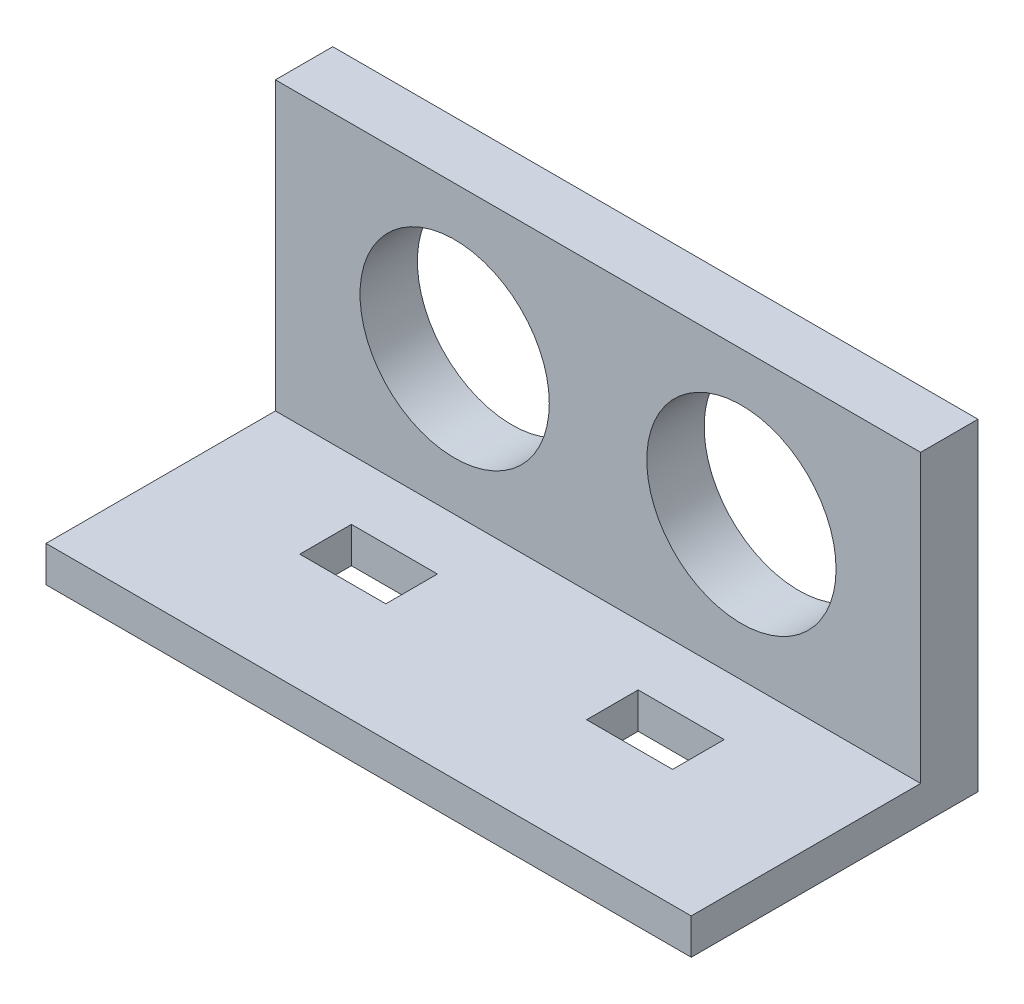
ISO-10303-21;
HEADER;
FILE_DESCRIPTION(('STEP AP214'),'2;1');
FILE_NAME('part.step','',(''),(''),'','','');
FILE_SCHEMA(('AUTOMOTIVE_DESIGN { 1 0 10303 214 1 1 1 1 }'));
ENDSEC;
DATA;
#1=APPLICATION_CONTEXT('core data for automotive mechanical design processes');
#2=APPLICATION_PROTOCOL_DEFINITION('international standard','automotive_design',2000,#1);
#3=PRODUCT_CONTEXT('',#1,'mechanical');
#4=PRODUCT('Part','Part','',(#3));
#5=PRODUCT_RELATED_PRODUCT_CATEGORY('part','',(#4));
#6=PRODUCT_DEFINITION_FORMATION('','',#4);
#7=PRODUCT_DEFINITION_CONTEXT('part definition',#1,'design');
#8=PRODUCT_DEFINITION('design','',#6,#7);
#9=PRODUCT_DEFINITION_SHAPE('','',#8);
#10=(LENGTH_UNIT() NAMED_UNIT(*) SI_UNIT(.MILLI.,.METRE.));
#11=(NAMED_UNIT(*) PLANE_ANGLE_UNIT() SI_UNIT($,.RADIAN.));
#12=(NAMED_UNIT(*) SI_UNIT($,.STERADIAN.) SOLID_ANGLE_UNIT());
#13=UNCERTAINTY_MEASURE_WITH_UNIT(LENGTH_MEASURE(1.E-05),#10,'distance_accuracy_value','');
#14=(GEOMETRIC_REPRESENTATION_CONTEXT(3) GLOBAL_UNCERTAINTY_ASSIGNED_CONTEXT((#13)) GLOBAL_UNIT_ASSIGNED_CONTEXT((#10,
#11,#12)) REPRESENTATION_CONTEXT('',''));
#15=CARTESIAN_POINT('',(0.,0.,0.));
#16=DIRECTION('',(0.,0.,1.));
#17=DIRECTION('',(1.,0.,0.));
#18=AXIS2_PLACEMENT_3D('',#15,#16,#17);
#19=CARTESIAN_POINT('',(54.1726683508479,-15.875,-5.08));
#20=DIRECTION('',(0.,-1.,0.));
#21=DIRECTION('',(1.,0.,0.));
#22=AXIS2_PLACEMENT_3D('',#19,#20,#21);
#23=PLANE('',#22);
#24=DIRECTION('',(0.,0.,-1.));
#25=VECTOR('',#24,1.);
#26=CARTESIAN_POINT('',(8.89,-15.875,-5.08));
#27=LINE('',#26,#25);
#28=CARTESIAN_POINT('',(8.89,-15.875,9.906));
#29=VERTEX_POINT('',#28);
#30=CARTESIAN_POINT('',(8.89,-15.875,5.334));
#31=VERTEX_POINT('',#30);
#32=EDGE_CURVE('E349',#29,#31,#27,.T.);
#33=ORIENTED_EDGE('',*,*,#32,.F.);
#34=DIRECTION('',(-1.,0.,0.));
#35=VECTOR('',#34,1.);
#36=CARTESIAN_POINT('',(54.1726683508479,-15.875,9.906));
#37=LINE('',#36,#35);
#38=CARTESIAN_POINT('',(16.51,-15.875,9.906));
#39=VERTEX_POINT('',#38);
#40=EDGE_CURVE('E342',#39,#29,#37,.T.);
#41=ORIENTED_EDGE('',*,*,#40,.F.);
#42=DIRECTION('',(0.,0.,1.));
#43=VECTOR('',#42,1.);
#44=CARTESIAN_POINT('',(16.51,-15.875,-5.08));
#45=LINE('',#44,#43);
#46=CARTESIAN_POINT('',(16.51,-15.875,5.334));
#47=VERTEX_POINT('',#46);
#48=EDGE_CURVE('E344',#47,#39,#45,.T.);
#49=ORIENTED_EDGE('',*,*,#48,.F.);
#50=DIRECTION('',(1.,0.,0.));
#51=VECTOR('',#50,1.);
#52=CARTESIAN_POINT('',(54.1726683508479,-15.875,5.334));
#53=LINE('',#52,#51);
#54=EDGE_CURVE('E347',#31,#47,#53,.T.);
#55=ORIENTED_EDGE('',*,*,#54,.F.);
#56=EDGE_LOOP('',(#33,#41,#49,#55));
#57=FACE_BOUND('',#56,.T.);
#58=DIRECTION('',(0.,0.,-1.));
#59=VECTOR('',#58,1.);
#60=CARTESIAN_POINT('',(-16.51,-15.875,-5.08));
#61=LINE('',#60,#59);
#62=CARTESIAN_POINT('',(-16.51,-15.875,9.906));
#63=VERTEX_POINT('',#62);
#64=CARTESIAN_POINT('',(-16.51,-15.875,5.334));
#65=VERTEX_POINT('',#64);
#66=EDGE_CURVE('E340',#63,#65,#61,.T.);
#67=ORIENTED_EDGE('',*,*,#66,.F.);
#68=DIRECTION('',(-1.,0.,0.));
#69=VECTOR('',#68,1.);
#70=CARTESIAN_POINT('',(54.1726683508479,-15.875,9.906));
#71=LINE('',#70,#69);
#72=CARTESIAN_POINT('',(-8.89,-15.875,9.906));
#73=VERTEX_POINT('',#72);
#74=EDGE_CURVE('E333',#73,#63,#71,.T.);
#75=ORIENTED_EDGE('',*,*,#74,.F.);
#76=DIRECTION('',(0.,0.,1.));
#77=VECTOR('',#76,1.);
#78=CARTESIAN_POINT('',(-8.89,-15.875,-5.08));
#79=LINE('',#78,#77);
#80=CARTESIAN_POINT('',(-8.89,-15.875,5.334));
#81=VERTEX_POINT('',#80);
#82=EDGE_CURVE('E335',#81,#73,#79,.T.);
#83=ORIENTED_EDGE('',*,*,#82,.F.);
#84=DIRECTION('',(1.,0.,0.));
#85=VECTOR('',#84,1.);
#86=CARTESIAN_POINT('',(54.1726683508479,-15.875,5.334));
#87=LINE('',#86,#85);
#88=EDGE_CURVE('E338',#65,#81,#87,.T.);
#89=ORIENTED_EDGE('',*,*,#88,.F.);
#90=EDGE_LOOP('',(#67,#75,#83,#89));
#91=FACE_BOUND('',#90,.T.);
#92=DIRECTION('',(-1.,0.,0.));
#93=VECTOR('',#92,1.);
#94=CARTESIAN_POINT('',(54.1726683508479,-15.875,-5.08));
#95=LINE('',#94,#93);
#96=CARTESIAN_POINT('',(28.575,-15.875,-5.08));
#97=VERTEX_POINT('',#96);
#98=CARTESIAN_POINT('',(-28.575,-15.875,-5.08));
#99=VERTEX_POINT('',#98);
#100=EDGE_CURVE('E298',#97,#99,#95,.T.);
#101=ORIENTED_EDGE('',*,*,#100,.F.);
#102=DIRECTION('',(0.,0.,1.));
#103=VECTOR('',#102,1.);
#104=CARTESIAN_POINT('',(28.575,-15.875,-5.08));
#105=LINE('',#104,#103);
#106=CARTESIAN_POINT('',(28.575,-15.875,20.32));
#107=VERTEX_POINT('',#106);
#108=EDGE_CURVE('E287',#97,#107,#105,.T.);
#109=ORIENTED_EDGE('',*,*,#108,.T.);
#110=DIRECTION('',(-1.,0.,0.));
#111=VECTOR('',#110,1.);
#112=CARTESIAN_POINT('',(54.1726683508479,-15.875,20.32));
#113=LINE('',#112,#111);
#114=CARTESIAN_POINT('',(-28.575,-15.875,20.32));
#115=VERTEX_POINT('',#114);
#116=EDGE_CURVE('E432',#107,#115,#113,.T.);
#117=ORIENTED_EDGE('',*,*,#116,.T.);
#118=DIRECTION('',(0.,0.,1.));
#119=VECTOR('',#118,1.);
#120=CARTESIAN_POINT('',(-28.575,-15.875,-5.08));
#121=LINE('',#120,#119);
#122=EDGE_CURVE('E271',#99,#115,#121,.T.);
#123=ORIENTED_EDGE('',*,*,#122,.F.);
#124=EDGE_LOOP('',(#101,#109,#117,#123));
#125=FACE_BOUND('',#124,.T.);
#126=DIRECTION('',(-1.,0.,0.));
#127=VECTOR('',#126,1.);
#128=CARTESIAN_POINT('',(-26.035,-15.875,10.16));
#129=LINE('',#128,#127);
#130=CARTESIAN_POINT('',(-20.955,-15.875,10.16));
#131=VERTEX_POINT('',#130);
#132=CARTESIAN_POINT('',(-26.035,-15.875,10.16));
#133=VERTEX_POINT('',#132);
#134=EDGE_CURVE('E227',#131,#133,#129,.T.);
#135=ORIENTED_EDGE('',*,*,#134,.F.);
#136=DIRECTION('',(0.,0.,1.));
#137=VECTOR('',#136,1.);
#138=CARTESIAN_POINT('',(-20.955,-15.875,5.08));
#139=LINE('',#138,#137);
#140=CARTESIAN_POINT('',(-20.955,-15.875,5.08));
#141=VERTEX_POINT('',#140);
#142=EDGE_CURVE('E200',#141,#131,#139,.T.);
#143=ORIENTED_EDGE('',*,*,#142,.F.);
#144=DIRECTION('',(1.,0.,0.));
#145=VECTOR('',#144,1.);
#146=CARTESIAN_POINT('',(-26.035,-15.875,5.08));
#147=LINE('',#146,#145);
#148=CARTESIAN_POINT('',(-26.035,-15.875,5.08));
#149=VERTEX_POINT('',#148);
#150=EDGE_CURVE('E219',#149,#141,#147,.T.);
#151=ORIENTED_EDGE('',*,*,#150,.F.);
#152=DIRECTION('',(0.,0.,-1.));
#153=VECTOR('',#152,1.);
#154=CARTESIAN_POINT('',(-26.035,-15.875,5.08));
#155=LINE('',#154,#153);
#156=EDGE_CURVE('E229',#133,#149,#155,.T.);
#157=ORIENTED_EDGE('',*,*,#156,.F.);
#158=EDGE_LOOP('',(#135,#143,#151,#157));
#159=FACE_BOUND('',#158,.T.);
#160=DIRECTION('',(-1.,0.,0.));
#161=VECTOR('',#160,1.);
#162=CARTESIAN_POINT('',(20.955,-15.875,10.16));
#163=LINE('',#162,#161);
#164=CARTESIAN_POINT('',(26.035,-15.875,10.16));
#165=VERTEX_POINT('',#164);
#166=CARTESIAN_POINT('',(20.955,-15.875,10.16));
#167=VERTEX_POINT('',#166);
#168=EDGE_CURVE('E196',#165,#167,#163,.T.);
#169=ORIENTED_EDGE('',*,*,#168,.F.);
#170=DIRECTION('',(0.,0.,1.));
#171=VECTOR('',#170,1.);
#172=CARTESIAN_POINT('',(26.035,-15.875,5.08));
#173=LINE('',#172,#171);
#174=CARTESIAN_POINT('',(26.035,-15.875,5.08));
#175=VERTEX_POINT('',#174);
#176=EDGE_CURVE('E208',#175,#165,#173,.T.);
#177=ORIENTED_EDGE('',*,*,#176,.F.);
#178=DIRECTION('',(1.,0.,0.));
#179=VECTOR('',#178,1.);
#180=CARTESIAN_POINT('',(20.955,-15.875,5.08));
#181=LINE('',#180,#179);
#182=CARTESIAN_POINT('',(20.955,-15.875,5.08));
#183=VERTEX_POINT('',#182);
#184=EDGE_CURVE('E190',#183,#175,#181,.T.);
#185=ORIENTED_EDGE('',*,*,#184,.F.);
#186=DIRECTION('',(0.,0.,-1.));
#187=VECTOR('',#186,1.);
#188=CARTESIAN_POINT('',(20.955,-15.875,5.08));
#189=LINE('',#188,#187);
#190=EDGE_CURVE('E211',#167,#183,#189,.T.);
#191=ORIENTED_EDGE('',*,*,#190,.F.);
#192=EDGE_LOOP('',(#169,#177,#185,#191));
#193=FACE_BOUND('',#192,.T.);
#194=ADVANCED_FACE('F35',(#57,#91,#125,#159,#193),#23,.T.);
#195=CARTESIAN_POINT('',(28.575,12.7,-5.08));
#196=DIRECTION('',(1.,0.,0.));
#197=DIRECTION('',(0.,1.,0.));
#198=AXIS2_PLACEMENT_3D('',#195,#196,#197);
#199=PLANE('',#198);
#200=DIRECTION('',(0.,1.,0.));
#201=VECTOR('',#200,1.);
#202=CARTESIAN_POINT('',(28.575,12.7,0.));
#203=LINE('',#202,#201);
#204=CARTESIAN_POINT('',(28.575,-12.7,0.));
#205=VERTEX_POINT('',#204);
#206=CARTESIAN_POINT('',(28.575,12.7,0.));
#207=VERTEX_POINT('',#206);
#208=EDGE_CURVE('E302',#205,#207,#203,.T.);
#209=ORIENTED_EDGE('',*,*,#208,.F.);
#210=DIRECTION('',(0.,0.,-1.));
#211=VECTOR('',#210,1.);
#212=CARTESIAN_POINT('',(28.575,-12.7,-5.08));
#213=LINE('',#212,#211);
#214=CARTESIAN_POINT('',(28.575,-12.7,20.32));
#215=VERTEX_POINT('',#214);
#216=EDGE_CURVE('E288',#215,#205,#213,.T.);
#217=ORIENTED_EDGE('',*,*,#216,.F.);
#218=DIRECTION('',(0.,1.,0.));
#219=VECTOR('',#218,1.);
#220=CARTESIAN_POINT('',(28.575,-12.7,20.32));
#221=LINE('',#220,#219);
#222=EDGE_CURVE('E429',#107,#215,#221,.T.);
#223=ORIENTED_EDGE('',*,*,#222,.F.);
#224=ORIENTED_EDGE('',*,*,#108,.F.);
#225=DIRECTION('',(0.,1.,0.));
#226=VECTOR('',#225,1.);
#227=CARTESIAN_POINT('',(28.575,12.7,-5.08));
#228=LINE('',#227,#226);
#229=CARTESIAN_POINT('',(28.575,12.7,-5.08));
#230=VERTEX_POINT('',#229);
#231=EDGE_CURVE('E305',#97,#230,#228,.T.);
#232=ORIENTED_EDGE('',*,*,#231,.T.);
#233=DIRECTION('',(0.,0.,1.));
#234=VECTOR('',#233,1.);
#235=CARTESIAN_POINT('',(28.575,12.7,-5.08));
#236=LINE('',#235,#234);
#237=EDGE_CURVE('E314',#230,#207,#236,.T.);
#238=ORIENTED_EDGE('',*,*,#237,.T.);
#239=EDGE_LOOP('',(#209,#217,#223,#224,#232,#238));
#240=FACE_BOUND('',#239,.T.);
#241=ADVANCED_FACE('F368',(#240),#199,.T.);
#242=CARTESIAN_POINT('',(-28.575,12.7,-5.08));
#243=DIRECTION('',(-1.,0.,0.));
#244=DIRECTION('',(0.,-1.,0.));
#245=AXIS2_PLACEMENT_3D('',#242,#243,#244);
#246=PLANE('',#245);
#247=DIRECTION('',(0.,-1.,0.));
#248=VECTOR('',#247,1.);
#249=CARTESIAN_POINT('',(-28.575,12.7,0.));
#250=LINE('',#249,#248);
#251=CARTESIAN_POINT('',(-28.575,12.7,0.));
#252=VERTEX_POINT('',#251);
#253=CARTESIAN_POINT('',(-28.575,-12.7,0.));
#254=VERTEX_POINT('',#253);
#255=EDGE_CURVE('E318',#252,#254,#250,.T.);
#256=ORIENTED_EDGE('',*,*,#255,.F.);
#257=DIRECTION('',(0.,0.,1.));
#258=VECTOR('',#257,1.);
#259=CARTESIAN_POINT('',(-28.575,12.7,-5.08));
#260=LINE('',#259,#258);
#261=CARTESIAN_POINT('',(-28.575,12.7,-5.08));
#262=VERTEX_POINT('',#261);
#263=EDGE_CURVE('E321',#262,#252,#260,.T.);
#264=ORIENTED_EDGE('',*,*,#263,.F.);
#265=DIRECTION('',(0.,-1.,0.));
#266=VECTOR('',#265,1.);
#267=CARTESIAN_POINT('',(-28.575,12.7,-5.08));
#268=LINE('',#267,#266);
#269=EDGE_CURVE('E312',#262,#99,#268,.T.);
#270=ORIENTED_EDGE('',*,*,#269,.T.);
#271=ORIENTED_EDGE('',*,*,#122,.T.);
#272=DIRECTION('',(0.,1.,0.));
#273=VECTOR('',#272,1.);
#274=CARTESIAN_POINT('',(-28.575,-12.7,20.32));
#275=LINE('',#274,#273);
#276=CARTESIAN_POINT('',(-28.575,-12.7,20.32));
#277=VERTEX_POINT('',#276);
#278=EDGE_CURVE('E280',#115,#277,#275,.T.);
#279=ORIENTED_EDGE('',*,*,#278,.T.);
#280=DIRECTION('',(0.,0.,-1.));
#281=VECTOR('',#280,1.);
#282=CARTESIAN_POINT('',(-28.575,-12.7,-5.08));
#283=LINE('',#282,#281);
#284=EDGE_CURVE('E283',#277,#254,#283,.T.);
#285=ORIENTED_EDGE('',*,*,#284,.T.);
#286=EDGE_LOOP('',(#256,#264,#270,#271,#279,#285));
#287=FACE_BOUND('',#286,.T.);
#288=ADVANCED_FACE('F374',(#287),#246,.T.);
#289=CARTESIAN_POINT('',(-28.575,12.7,-5.08));
#290=DIRECTION('',(0.,1.,0.));
#291=DIRECTION('',(0.,0.,1.));
#292=AXIS2_PLACEMENT_3D('',#289,#290,#291);
#293=PLANE('',#292);
#294=DIRECTION('',(-1.,0.,0.));
#295=VECTOR('',#294,1.);
#296=CARTESIAN_POINT('',(-28.575,12.7,0.));
#297=LINE('',#296,#295);
#298=EDGE_CURVE('E315',#207,#252,#297,.T.);
#299=ORIENTED_EDGE('',*,*,#298,.F.);
#300=ORIENTED_EDGE('',*,*,#237,.F.);
#301=DIRECTION('',(-1.,0.,0.));
#302=VECTOR('',#301,1.);
#303=CARTESIAN_POINT('',(-28.575,12.7,-5.08));
#304=LINE('',#303,#302);
#305=EDGE_CURVE('E308',#230,#262,#304,.T.);
#306=ORIENTED_EDGE('',*,*,#305,.T.);
#307=ORIENTED_EDGE('',*,*,#263,.T.);
#308=EDGE_LOOP('',(#299,#300,#306,#307));
#309=FACE_BOUND('',#308,.T.);
#310=ADVANCED_FACE('F396',(#309),#293,.T.);
#311=CARTESIAN_POINT('',(0.,0.,-5.08));
#312=DIRECTION('',(0.,0.,1.));
#313=DIRECTION('',(1.,0.,0.));
#314=AXIS2_PLACEMENT_3D('',#311,#312,#313);
#315=PLANE('',#314);
#316=CARTESIAN_POINT('',(12.7,0.,-5.08));
#317=DIRECTION('',(0.,0.,1.));
#318=DIRECTION('',(1.,0.,0.));
#319=AXIS2_PLACEMENT_3D('',#316,#317,#318);
#320=CIRCLE('',#319,8.382);
#321=CARTESIAN_POINT('',(21.082,0.,-5.08));
#322=VERTEX_POINT('',#321);
#323=EDGE_CURVE('E291',#322,#322,#320,.T.);
#324=ORIENTED_EDGE('',*,*,#323,.T.);
#325=EDGE_LOOP('',(#324));
#326=FACE_BOUND('',#325,.T.);
#327=CARTESIAN_POINT('',(-12.7,0.,-5.08));
#328=DIRECTION('',(0.,0.,1.));
#329=DIRECTION('',(1.,0.,0.));
#330=AXIS2_PLACEMENT_3D('',#327,#328,#329);
#331=CIRCLE('',#330,8.382);
#332=CARTESIAN_POINT('',(-4.318,0.,-5.08));
#333=VERTEX_POINT('',#332);
#334=EDGE_CURVE('E299',#333,#333,#331,.T.);
#335=ORIENTED_EDGE('',*,*,#334,.T.);
#336=EDGE_LOOP('',(#335));
#337=FACE_BOUND('',#336,.T.);
#338=ORIENTED_EDGE('',*,*,#231,.F.);
#339=ORIENTED_EDGE('',*,*,#100,.T.);
#340=ORIENTED_EDGE('',*,*,#269,.F.);
#341=ORIENTED_EDGE('',*,*,#305,.F.);
#342=EDGE_LOOP('',(#338,#339,#340,#341));
#343=FACE_BOUND('',#342,.T.);
#344=ADVANCED_FACE('F393',(#326,#337,#343),#315,.F.);
#345=CARTESIAN_POINT('',(0.,0.,0.));
#346=DIRECTION('',(0.,0.,1.));
#347=DIRECTION('',(1.,0.,0.));
#348=AXIS2_PLACEMENT_3D('',#345,#346,#347);
#349=PLANE('',#348);
#350=CARTESIAN_POINT('',(12.7,0.,0.));
#351=DIRECTION('',(0.,0.,1.));
#352=DIRECTION('',(1.,0.,0.));
#353=AXIS2_PLACEMENT_3D('',#350,#351,#352);
#354=CIRCLE('',#353,8.382);
#355=CARTESIAN_POINT('',(21.082,0.,0.));
#356=VERTEX_POINT('',#355);
#357=EDGE_CURVE('E295',#356,#356,#354,.T.);
#358=ORIENTED_EDGE('',*,*,#357,.F.);
#359=EDGE_LOOP('',(#358));
#360=FACE_BOUND('',#359,.T.);
#361=CARTESIAN_POINT('',(-12.7,0.,0.));
#362=DIRECTION('',(0.,0.,1.));
#363=DIRECTION('',(1.,0.,0.));
#364=AXIS2_PLACEMENT_3D('',#361,#362,#363);
#365=CIRCLE('',#364,8.382);
#366=CARTESIAN_POINT('',(-4.318,0.,0.));
#367=VERTEX_POINT('',#366);
#368=EDGE_CURVE('E294',#367,#367,#365,.T.);
#369=ORIENTED_EDGE('',*,*,#368,.F.);
#370=EDGE_LOOP('',(#369));
#371=FACE_BOUND('',#370,.T.);
#372=ORIENTED_EDGE('',*,*,#208,.T.);
#373=ORIENTED_EDGE('',*,*,#298,.T.);
#374=ORIENTED_EDGE('',*,*,#255,.T.);
#375=DIRECTION('',(1.,0.,0.));
#376=VECTOR('',#375,1.);
#377=CARTESIAN_POINT('',(-28.575,-12.7,0.));
#378=LINE('',#377,#376);
#379=EDGE_CURVE('E309',#254,#205,#378,.T.);
#380=ORIENTED_EDGE('',*,*,#379,.T.);
#381=EDGE_LOOP('',(#372,#373,#374,#380));
#382=FACE_BOUND('',#381,.T.);
#383=ADVANCED_FACE('F391',(#360,#371,#382),#349,.T.);
#384=CARTESIAN_POINT('',(-12.7,0.,-5.08));
#385=DIRECTION('',(0.,0.,1.));
#386=DIRECTION('',(1.,0.,0.));
#387=AXIS2_PLACEMENT_3D('',#384,#385,#386);
#388=CYLINDRICAL_SURFACE('',#387,8.382);
#389=ORIENTED_EDGE('',*,*,#334,.F.);
#390=EDGE_LOOP('',(#389));
#391=FACE_BOUND('',#390,.T.);
#392=ORIENTED_EDGE('',*,*,#368,.T.);
#393=EDGE_LOOP('',(#392));
#394=FACE_BOUND('',#393,.T.);
#395=ADVANCED_FACE('F387',(#391,#394),#388,.F.);
#396=CARTESIAN_POINT('',(12.7,0.,-5.08));
#397=DIRECTION('',(0.,0.,1.));
#398=DIRECTION('',(1.,0.,0.));
#399=AXIS2_PLACEMENT_3D('',#396,#397,#398);
#400=CYLINDRICAL_SURFACE('',#399,8.382);
#401=ORIENTED_EDGE('',*,*,#323,.F.);
#402=EDGE_LOOP('',(#401));
#403=FACE_BOUND('',#402,.T.);
#404=ORIENTED_EDGE('',*,*,#357,.T.);
#405=EDGE_LOOP('',(#404));
#406=FACE_BOUND('',#405,.T.);
#407=ADVANCED_FACE('F383',(#403,#406),#400,.F.);
#408=CARTESIAN_POINT('',(54.1726683508479,-12.7,-5.08));
#409=DIRECTION('',(0.,1.,0.));
#410=DIRECTION('',(-1.,0.,0.));
#411=AXIS2_PLACEMENT_3D('',#408,#409,#410);
#412=PLANE('',#411);
#413=DIRECTION('',(0.,0.,1.));
#414=VECTOR('',#413,1.);
#415=CARTESIAN_POINT('',(8.89,-12.7,5.334));
#416=LINE('',#415,#414);
#417=CARTESIAN_POINT('',(8.89,-12.7,5.334));
#418=VERTEX_POINT('',#417);
#419=CARTESIAN_POINT('',(8.89,-12.7,9.906));
#420=VERTEX_POINT('',#419);
#421=EDGE_CURVE('E237',#418,#420,#416,.T.);
#422=ORIENTED_EDGE('',*,*,#421,.F.);
#423=DIRECTION('',(-1.,0.,0.));
#424=VECTOR('',#423,1.);
#425=CARTESIAN_POINT('',(8.89,-12.7,5.334));
#426=LINE('',#425,#424);
#427=CARTESIAN_POINT('',(16.51,-12.7,5.334));
#428=VERTEX_POINT('',#427);
#429=EDGE_CURVE('E245',#428,#418,#426,.T.);
#430=ORIENTED_EDGE('',*,*,#429,.F.);
#431=DIRECTION('',(0.,0.,-1.));
#432=VECTOR('',#431,1.);
#433=CARTESIAN_POINT('',(16.51,-12.7,5.334));
#434=LINE('',#433,#432);
#435=CARTESIAN_POINT('',(16.51,-12.7,9.906));
#436=VERTEX_POINT('',#435);
#437=EDGE_CURVE('E242',#436,#428,#434,.T.);
#438=ORIENTED_EDGE('',*,*,#437,.F.);
#439=DIRECTION('',(1.,0.,0.));
#440=VECTOR('',#439,1.);
#441=CARTESIAN_POINT('',(8.89,-12.7,9.906));
#442=LINE('',#441,#440);
#443=EDGE_CURVE('E239',#420,#436,#442,.T.);
#444=ORIENTED_EDGE('',*,*,#443,.F.);
#445=EDGE_LOOP('',(#422,#430,#438,#444));
#446=FACE_BOUND('',#445,.T.);
#447=DIRECTION('',(0.,0.,1.));
#448=VECTOR('',#447,1.);
#449=CARTESIAN_POINT('',(-16.51,-12.7,5.334));
#450=LINE('',#449,#448);
#451=CARTESIAN_POINT('',(-16.51,-12.7,5.334));
#452=VERTEX_POINT('',#451);
#453=CARTESIAN_POINT('',(-16.51,-12.7,9.906));
#454=VERTEX_POINT('',#453);
#455=EDGE_CURVE('E251',#452,#454,#450,.T.);
#456=ORIENTED_EDGE('',*,*,#455,.F.);
#457=DIRECTION('',(-1.,0.,0.));
#458=VECTOR('',#457,1.);
#459=CARTESIAN_POINT('',(-16.51,-12.7,5.334));
#460=LINE('',#459,#458);
#461=CARTESIAN_POINT('',(-8.89,-12.7,5.334));
#462=VERTEX_POINT('',#461);
#463=EDGE_CURVE('E265',#462,#452,#460,.T.);
#464=ORIENTED_EDGE('',*,*,#463,.F.);
#465=DIRECTION('',(0.,0.,-1.));
#466=VECTOR('',#465,1.);
#467=CARTESIAN_POINT('',(-8.89,-12.7,5.334));
#468=LINE('',#467,#466);
#469=CARTESIAN_POINT('',(-8.89,-12.7,9.906));
#470=VERTEX_POINT('',#469);
#471=EDGE_CURVE('E262',#470,#462,#468,.T.);
#472=ORIENTED_EDGE('',*,*,#471,.F.);
#473=DIRECTION('',(1.,0.,0.));
#474=VECTOR('',#473,1.);
#475=CARTESIAN_POINT('',(-16.51,-12.7,9.906));
#476=LINE('',#475,#474);
#477=EDGE_CURVE('E259',#454,#470,#476,.T.);
#478=ORIENTED_EDGE('',*,*,#477,.F.);
#479=EDGE_LOOP('',(#456,#464,#472,#478));
#480=FACE_BOUND('',#479,.T.);
#481=ORIENTED_EDGE('',*,*,#379,.F.);
#482=ORIENTED_EDGE('',*,*,#284,.F.);
#483=DIRECTION('',(-1.,0.,0.));
#484=VECTOR('',#483,1.);
#485=CARTESIAN_POINT('',(54.1726683508479,-12.7,20.32));
#486=LINE('',#485,#484);
#487=EDGE_CURVE('E427',#215,#277,#486,.T.);
#488=ORIENTED_EDGE('',*,*,#487,.F.);
#489=ORIENTED_EDGE('',*,*,#216,.T.);
#490=EDGE_LOOP('',(#481,#482,#488,#489));
#491=FACE_BOUND('',#490,.T.);
#492=ADVANCED_FACE('F386',(#446,#480,#491),#412,.T.);
#493=CARTESIAN_POINT('',(54.1726683508479,-12.7,20.32));
#494=DIRECTION('',(0.,0.,1.));
#495=DIRECTION('',(1.,0.,0.));
#496=AXIS2_PLACEMENT_3D('',#493,#494,#495);
#497=PLANE('',#496);
#498=ORIENTED_EDGE('',*,*,#116,.F.);
#499=ORIENTED_EDGE('',*,*,#222,.T.);
#500=ORIENTED_EDGE('',*,*,#487,.T.);
#501=ORIENTED_EDGE('',*,*,#278,.F.);
#502=EDGE_LOOP('',(#498,#499,#500,#501));
#503=FACE_BOUND('',#502,.T.);
#504=ADVANCED_FACE('F381',(#503),#497,.T.);
#505=CARTESIAN_POINT('',(-16.51,-17.78,5.334));
#506=DIRECTION('',(-1.,0.,0.));
#507=DIRECTION('',(0.,-1.,0.));
#508=AXIS2_PLACEMENT_3D('',#505,#506,#507);
#509=PLANE('',#508);
#510=ORIENTED_EDGE('',*,*,#66,.T.);
#511=DIRECTION('',(0.,1.,0.));
#512=VECTOR('',#511,1.);
#513=CARTESIAN_POINT('',(-16.51,-17.78,5.334));
#514=LINE('',#513,#512);
#515=EDGE_CURVE('E269',#65,#452,#514,.T.);
#516=ORIENTED_EDGE('',*,*,#515,.T.);
#517=ORIENTED_EDGE('',*,*,#455,.T.);
#518=DIRECTION('',(0.,1.,0.));
#519=VECTOR('',#518,1.);
#520=CARTESIAN_POINT('',(-16.51,-17.78,9.906));
#521=LINE('',#520,#519);
#522=EDGE_CURVE('E268',#63,#454,#521,.T.);
#523=ORIENTED_EDGE('',*,*,#522,.F.);
#524=EDGE_LOOP('',(#510,#516,#517,#523));
#525=FACE_BOUND('',#524,.T.);
#526=ADVANCED_FACE('F493',(#525),#509,.F.);
#527=CARTESIAN_POINT('',(-16.51,-17.78,5.334));
#528=DIRECTION('',(0.,0.,-1.));
#529=DIRECTION('',(-1.,0.,0.));
#530=AXIS2_PLACEMENT_3D('',#527,#528,#529);
#531=PLANE('',#530);
#532=ORIENTED_EDGE('',*,*,#88,.T.);
#533=DIRECTION('',(0.,1.,0.));
#534=VECTOR('',#533,1.);
#535=CARTESIAN_POINT('',(-8.89,-17.78,5.334));
#536=LINE('',#535,#534);
#537=EDGE_CURVE('E272',#81,#462,#536,.T.);
#538=ORIENTED_EDGE('',*,*,#537,.T.);
#539=ORIENTED_EDGE('',*,*,#463,.T.);
#540=ORIENTED_EDGE('',*,*,#515,.F.);
#541=EDGE_LOOP('',(#532,#538,#539,#540));
#542=FACE_BOUND('',#541,.T.);
#543=ADVANCED_FACE('F489',(#542),#531,.F.);
#544=CARTESIAN_POINT('',(-8.89,-17.78,5.334));
#545=DIRECTION('',(1.,0.,0.));
#546=DIRECTION('',(0.,1.,0.));
#547=AXIS2_PLACEMENT_3D('',#544,#545,#546);
#548=PLANE('',#547);
#549=ORIENTED_EDGE('',*,*,#82,.T.);
#550=DIRECTION('',(0.,1.,0.));
#551=VECTOR('',#550,1.);
#552=CARTESIAN_POINT('',(-8.89,-17.78,9.906));
#553=LINE('',#552,#551);
#554=EDGE_CURVE('E274',#73,#470,#553,.T.);
#555=ORIENTED_EDGE('',*,*,#554,.T.);
#556=ORIENTED_EDGE('',*,*,#471,.T.);
#557=ORIENTED_EDGE('',*,*,#537,.F.);
#558=EDGE_LOOP('',(#549,#555,#556,#557));
#559=FACE_BOUND('',#558,.T.);
#560=ADVANCED_FACE('F492',(#559),#548,.F.);
#561=CARTESIAN_POINT('',(-16.51,-17.78,9.906));
#562=DIRECTION('',(0.,0.,1.));
#563=DIRECTION('',(1.,0.,0.));
#564=AXIS2_PLACEMENT_3D('',#561,#562,#563);
#565=PLANE('',#564);
#566=ORIENTED_EDGE('',*,*,#74,.T.);
#567=ORIENTED_EDGE('',*,*,#522,.T.);
#568=ORIENTED_EDGE('',*,*,#477,.T.);
#569=ORIENTED_EDGE('',*,*,#554,.F.);
#570=EDGE_LOOP('',(#566,#567,#568,#569));
#571=FACE_BOUND('',#570,.T.);
#572=ADVANCED_FACE('F487',(#571),#565,.F.);
#573=CARTESIAN_POINT('',(8.89,-17.78,5.334));
#574=DIRECTION('',(-1.,0.,0.));
#575=DIRECTION('',(0.,-1.,0.));
#576=AXIS2_PLACEMENT_3D('',#573,#574,#575);
#577=PLANE('',#576);
#578=ORIENTED_EDGE('',*,*,#32,.T.);
#579=DIRECTION('',(0.,1.,0.));
#580=VECTOR('',#579,1.);
#581=CARTESIAN_POINT('',(8.89,-17.78,5.334));
#582=LINE('',#581,#580);
#583=EDGE_CURVE('E249',#31,#418,#582,.T.);
#584=ORIENTED_EDGE('',*,*,#583,.T.);
#585=ORIENTED_EDGE('',*,*,#421,.T.);
#586=DIRECTION('',(0.,1.,0.));
#587=VECTOR('',#586,1.);
#588=CARTESIAN_POINT('',(8.89,-17.78,9.906));
#589=LINE('',#588,#587);
#590=EDGE_CURVE('E248',#29,#420,#589,.T.);
#591=ORIENTED_EDGE('',*,*,#590,.F.);
#592=EDGE_LOOP('',(#578,#584,#585,#591));
#593=FACE_BOUND('',#592,.T.);
#594=ADVANCED_FACE('F477',(#593),#577,.F.);
#595=CARTESIAN_POINT('',(8.89,-17.78,5.334));
#596=DIRECTION('',(0.,0.,-1.));
#597=DIRECTION('',(-1.,0.,0.));
#598=AXIS2_PLACEMENT_3D('',#595,#596,#597);
#599=PLANE('',#598);
#600=ORIENTED_EDGE('',*,*,#54,.T.);
#601=DIRECTION('',(0.,1.,0.));
#602=VECTOR('',#601,1.);
#603=CARTESIAN_POINT('',(16.51,-17.78,5.334));
#604=LINE('',#603,#602);
#605=EDGE_CURVE('E252',#47,#428,#604,.T.);
#606=ORIENTED_EDGE('',*,*,#605,.T.);
#607=ORIENTED_EDGE('',*,*,#429,.T.);
#608=ORIENTED_EDGE('',*,*,#583,.F.);
#609=EDGE_LOOP('',(#600,#606,#607,#608));
#610=FACE_BOUND('',#609,.T.);
#611=ADVANCED_FACE('F473',(#610),#599,.F.);
#612=CARTESIAN_POINT('',(16.51,-17.78,5.334));
#613=DIRECTION('',(1.,0.,0.));
#614=DIRECTION('',(0.,1.,0.));
#615=AXIS2_PLACEMENT_3D('',#612,#613,#614);
#616=PLANE('',#615);
#617=ORIENTED_EDGE('',*,*,#48,.T.);
#618=DIRECTION('',(0.,1.,0.));
#619=VECTOR('',#618,1.);
#620=CARTESIAN_POINT('',(16.51,-17.78,9.906));
#621=LINE('',#620,#619);
#622=EDGE_CURVE('E254',#39,#436,#621,.T.);
#623=ORIENTED_EDGE('',*,*,#622,.T.);
#624=ORIENTED_EDGE('',*,*,#437,.T.);
#625=ORIENTED_EDGE('',*,*,#605,.F.);
#626=EDGE_LOOP('',(#617,#623,#624,#625));
#627=FACE_BOUND('',#626,.T.);
#628=ADVANCED_FACE('F476',(#627),#616,.F.);
#629=CARTESIAN_POINT('',(8.89,-17.78,9.906));
#630=DIRECTION('',(0.,0.,1.));
#631=DIRECTION('',(1.,0.,0.));
#632=AXIS2_PLACEMENT_3D('',#629,#630,#631);
#633=PLANE('',#632);
#634=ORIENTED_EDGE('',*,*,#40,.T.);
#635=ORIENTED_EDGE('',*,*,#590,.T.);
#636=ORIENTED_EDGE('',*,*,#443,.T.);
#637=ORIENTED_EDGE('',*,*,#622,.F.);
#638=EDGE_LOOP('',(#634,#635,#636,#637));
#639=FACE_BOUND('',#638,.T.);
#640=ADVANCED_FACE('F472',(#639),#633,.F.);
#641=CARTESIAN_POINT('',(-20.955,-18.415,5.08));
#642=DIRECTION('',(-1.,0.,0.));
#643=DIRECTION('',(0.,-1.,0.));
#644=AXIS2_PLACEMENT_3D('',#641,#642,#643);
#645=PLANE('',#644);
#646=ORIENTED_EDGE('',*,*,#142,.T.);
#647=DIRECTION('',(0.,1.,0.));
#648=VECTOR('',#647,1.);
#649=CARTESIAN_POINT('',(-20.955,-18.415,10.16));
#650=LINE('',#649,#648);
#651=CARTESIAN_POINT('',(-20.955,-18.415,10.16));
#652=VERTEX_POINT('',#651);
#653=EDGE_CURVE('E235',#652,#131,#650,.T.);
#654=ORIENTED_EDGE('',*,*,#653,.F.);
#655=DIRECTION('',(0.,0.,1.));
#656=VECTOR('',#655,1.);
#657=CARTESIAN_POINT('',(-20.955,-18.415,5.08));
#658=LINE('',#657,#656);
#659=CARTESIAN_POINT('',(-20.955,-18.415,5.08));
#660=VERTEX_POINT('',#659);
#661=EDGE_CURVE('E215',#660,#652,#658,.T.);
#662=ORIENTED_EDGE('',*,*,#661,.F.);
#663=DIRECTION('',(0.,1.,0.));
#664=VECTOR('',#663,1.);
#665=CARTESIAN_POINT('',(-20.955,-18.415,5.08));
#666=LINE('',#665,#664);
#667=EDGE_CURVE('E224',#660,#141,#666,.T.);
#668=ORIENTED_EDGE('',*,*,#667,.T.);
#669=EDGE_LOOP('',(#646,#654,#662,#668));
#670=FACE_BOUND('',#669,.T.);
#671=ADVANCED_FACE('F450',(#670),#645,.F.);
#672=CARTESIAN_POINT('',(-26.035,-18.415,10.16));
#673=DIRECTION('',(0.,0.,-1.));
#674=DIRECTION('',(-1.,0.,0.));
#675=AXIS2_PLACEMENT_3D('',#672,#673,#674);
#676=PLANE('',#675);
#677=ORIENTED_EDGE('',*,*,#134,.T.);
#678=DIRECTION('',(-0.707106781186547,0.707106781186549,0.));
#679=VECTOR('',#678,1.);
#680=CARTESIAN_POINT('',(-23.495,-18.415,10.16));
#681=LINE('',#680,#679);
#682=CARTESIAN_POINT('',(-23.495,-18.415,10.16));
#683=VERTEX_POINT('',#682);
#684=EDGE_CURVE('E356',#133,#683,#681,.F.);
#685=ORIENTED_EDGE('',*,*,#684,.T.);
#686=DIRECTION('',(-1.,0.,0.));
#687=VECTOR('',#686,1.);
#688=CARTESIAN_POINT('',(-26.035,-18.415,10.16));
#689=LINE('',#688,#687);
#690=EDGE_CURVE('E218',#652,#683,#689,.T.);
#691=ORIENTED_EDGE('',*,*,#690,.F.);
#692=ORIENTED_EDGE('',*,*,#653,.T.);
#693=EDGE_LOOP('',(#677,#685,#691,#692));
#694=FACE_BOUND('',#693,.T.);
#695=ADVANCED_FACE('F446',(#694),#676,.F.);
#696=CARTESIAN_POINT('',(-26.035,-18.415,5.08));
#697=DIRECTION('',(0.,0.,1.));
#698=DIRECTION('',(1.,0.,0.));
#699=AXIS2_PLACEMENT_3D('',#696,#697,#698);
#700=PLANE('',#699);
#701=DIRECTION('',(1.,0.,0.));
#702=VECTOR('',#701,1.);
#703=CARTESIAN_POINT('',(-26.035,-18.415,5.08));
#704=LINE('',#703,#702);
#705=CARTESIAN_POINT('',(-23.495,-18.415,5.08));
#706=VERTEX_POINT('',#705);
#707=EDGE_CURVE('E222',#706,#660,#704,.T.);
#708=ORIENTED_EDGE('',*,*,#707,.F.);
#709=DIRECTION('',(0.707106781186547,-0.707106781186549,0.));
#710=VECTOR('',#709,1.);
#711=CARTESIAN_POINT('',(-23.495,-18.415,5.08));
#712=LINE('',#711,#710);
#713=EDGE_CURVE('E354',#706,#149,#712,.F.);
#714=ORIENTED_EDGE('',*,*,#713,.T.);
#715=ORIENTED_EDGE('',*,*,#150,.T.);
#716=ORIENTED_EDGE('',*,*,#667,.F.);
#717=EDGE_LOOP('',(#708,#714,#715,#716));
#718=FACE_BOUND('',#717,.T.);
#719=ADVANCED_FACE('F454',(#718),#700,.F.);
#720=CARTESIAN_POINT('',(0.,-18.415,0.));
#721=DIRECTION('',(0.,1.,0.));
#722=DIRECTION('',(0.,0.,1.));
#723=AXIS2_PLACEMENT_3D('',#720,#721,#722);
#724=PLANE('',#723);
#725=ORIENTED_EDGE('',*,*,#690,.T.);
#726=DIRECTION('',(0.,0.,-1.));
#727=VECTOR('',#726,1.);
#728=CARTESIAN_POINT('',(-23.495,-18.415,0.));
#729=LINE('',#728,#727);
#730=EDGE_CURVE('E351',#683,#706,#729,.T.);
#731=ORIENTED_EDGE('',*,*,#730,.T.);
#732=ORIENTED_EDGE('',*,*,#707,.T.);
#733=ORIENTED_EDGE('',*,*,#661,.T.);
#734=EDGE_LOOP('',(#725,#731,#732,#733));
#735=FACE_BOUND('',#734,.T.);
#736=ADVANCED_FACE('F457',(#735),#724,.F.);
#737=CARTESIAN_POINT('',(20.955,-18.415,10.16));
#738=DIRECTION('',(0.,0.,-1.));
#739=DIRECTION('',(-1.,0.,0.));
#740=AXIS2_PLACEMENT_3D('',#737,#738,#739);
#741=PLANE('',#740);
#742=DIRECTION('',(-1.,0.,0.));
#743=VECTOR('',#742,1.);
#744=CARTESIAN_POINT('',(20.955,-18.415,10.16));
#745=LINE('',#744,#743);
#746=CARTESIAN_POINT('',(23.495,-18.415,10.16));
#747=VERTEX_POINT('',#746);
#748=CARTESIAN_POINT('',(20.955,-18.415,10.16));
#749=VERTEX_POINT('',#748);
#750=EDGE_CURVE('E182',#747,#749,#745,.T.);
#751=ORIENTED_EDGE('',*,*,#750,.F.);
#752=DIRECTION('',(-0.707106781186547,-0.707106781186549,0.));
#753=VECTOR('',#752,1.);
#754=CARTESIAN_POINT('',(23.495,-18.415,10.16));
#755=LINE('',#754,#753);
#756=EDGE_CURVE('E43',#747,#165,#755,.F.);
#757=ORIENTED_EDGE('',*,*,#756,.T.);
#758=ORIENTED_EDGE('',*,*,#168,.T.);
#759=DIRECTION('',(0.,1.,0.));
#760=VECTOR('',#759,1.);
#761=CARTESIAN_POINT('',(20.955,-18.415,10.16));
#762=LINE('',#761,#760);
#763=EDGE_CURVE('E193',#749,#167,#762,.T.);
#764=ORIENTED_EDGE('',*,*,#763,.F.);
#765=EDGE_LOOP('',(#751,#757,#758,#764));
#766=FACE_BOUND('',#765,.T.);
#767=ADVANCED_FACE('F194',(#766),#741,.F.);
#768=CARTESIAN_POINT('',(20.955,-18.415,5.08));
#769=DIRECTION('',(1.,0.,0.));
#770=DIRECTION('',(0.,1.,0.));
#771=AXIS2_PLACEMENT_3D('',#768,#769,#770);
#772=PLANE('',#771);
#773=ORIENTED_EDGE('',*,*,#190,.T.);
#774=DIRECTION('',(0.,1.,0.));
#775=VECTOR('',#774,1.);
#776=CARTESIAN_POINT('',(20.955,-18.415,5.08));
#777=LINE('',#776,#775);
#778=CARTESIAN_POINT('',(20.955,-18.415,5.08));
#779=VERTEX_POINT('',#778);
#780=EDGE_CURVE('E201',#779,#183,#777,.T.);
#781=ORIENTED_EDGE('',*,*,#780,.F.);
#782=DIRECTION('',(0.,0.,-1.));
#783=VECTOR('',#782,1.);
#784=CARTESIAN_POINT('',(20.955,-18.415,5.08));
#785=LINE('',#784,#783);
#786=EDGE_CURVE('E186',#749,#779,#785,.T.);
#787=ORIENTED_EDGE('',*,*,#786,.F.);
#788=ORIENTED_EDGE('',*,*,#763,.T.);
#789=EDGE_LOOP('',(#773,#781,#787,#788));
#790=FACE_BOUND('',#789,.T.);
#791=ADVANCED_FACE('F203',(#790),#772,.F.);
#792=CARTESIAN_POINT('',(20.955,-18.415,5.08));
#793=DIRECTION('',(0.,0.,1.));
#794=DIRECTION('',(1.,0.,0.));
#795=AXIS2_PLACEMENT_3D('',#792,#793,#794);
#796=PLANE('',#795);
#797=ORIENTED_EDGE('',*,*,#184,.T.);
#798=DIRECTION('',(0.707106781186547,0.707106781186549,0.));
#799=VECTOR('',#798,1.);
#800=CARTESIAN_POINT('',(23.495,-18.415,5.08));
#801=LINE('',#800,#799);
#802=CARTESIAN_POINT('',(23.495,-18.415,5.08));
#803=VERTEX_POINT('',#802);
#804=EDGE_CURVE('E11',#175,#803,#801,.F.);
#805=ORIENTED_EDGE('',*,*,#804,.T.);
#806=DIRECTION('',(1.,0.,0.));
#807=VECTOR('',#806,1.);
#808=CARTESIAN_POINT('',(20.955,-18.415,5.08));
#809=LINE('',#808,#807);
#810=EDGE_CURVE('E204',#779,#803,#809,.T.);
#811=ORIENTED_EDGE('',*,*,#810,.F.);
#812=ORIENTED_EDGE('',*,*,#780,.T.);
#813=EDGE_LOOP('',(#797,#805,#811,#812));
#814=FACE_BOUND('',#813,.T.);
#815=ADVANCED_FACE('F595',(#814),#796,.F.);
#816=CARTESIAN_POINT('',(0.,-18.415,0.));
#817=DIRECTION('',(0.,1.,0.));
#818=DIRECTION('',(0.,0.,1.));
#819=AXIS2_PLACEMENT_3D('',#816,#817,#818);
#820=PLANE('',#819);
#821=ORIENTED_EDGE('',*,*,#810,.T.);
#822=DIRECTION('',(0.,0.,1.));
#823=VECTOR('',#822,1.);
#824=CARTESIAN_POINT('',(23.495,-18.415,0.));
#825=LINE('',#824,#823);
#826=EDGE_CURVE('E188',#803,#747,#825,.T.);
#827=ORIENTED_EDGE('',*,*,#826,.T.);
#828=ORIENTED_EDGE('',*,*,#750,.T.);
#829=ORIENTED_EDGE('',*,*,#786,.T.);
#830=EDGE_LOOP('',(#821,#827,#828,#829));
#831=FACE_BOUND('',#830,.T.);
#832=ADVANCED_FACE('F184',(#831),#820,.F.);
#833=CARTESIAN_POINT('',(-23.495,-18.415,0.));
#834=DIRECTION('',(0.707106781186549,0.707106781186547,0.));
#835=DIRECTION('',(0.,0.,-1.));
#836=AXIS2_PLACEMENT_3D('',#833,#834,#835);
#837=PLANE('',#836);
#838=ORIENTED_EDGE('',*,*,#684,.F.);
#839=ORIENTED_EDGE('',*,*,#156,.T.);
#840=ORIENTED_EDGE('',*,*,#713,.F.);
#841=ORIENTED_EDGE('',*,*,#730,.F.);
#842=EDGE_LOOP('',(#838,#839,#840,#841));
#843=FACE_BOUND('',#842,.T.);
#844=ADVANCED_FACE('F362',(#843),#837,.F.);
#845=CARTESIAN_POINT('',(23.495,-18.415,0.));
#846=DIRECTION('',(-0.707106781186549,0.707106781186547,0.));
#847=DIRECTION('',(0.,0.,1.));
#848=AXIS2_PLACEMENT_3D('',#845,#846,#847);
#849=PLANE('',#848);
#850=ORIENTED_EDGE('',*,*,#804,.F.);
#851=ORIENTED_EDGE('',*,*,#176,.T.);
#852=ORIENTED_EDGE('',*,*,#756,.F.);
#853=ORIENTED_EDGE('',*,*,#826,.F.);
#854=EDGE_LOOP('',(#850,#851,#852,#853));
#855=FACE_BOUND('',#854,.T.);
#856=ADVANCED_FACE('F37',(#855),#849,.F.);
#857=CLOSED_SHELL('',(#194,#241,#288,#310,#344,#383,#395,#407,#492,#504,#526,#543,#560,#572,
#594,#611,#628,#640,#671,#695,#719,#736,#767,#791,#815,#832,#844,#856));
#858=MANIFOLD_SOLID_BREP('B2',#857);
#859=ADVANCED_BREP_SHAPE_REPRESENTATION('',(#18,#858),#14);
#860=SHAPE_DEFINITION_REPRESENTATION(#9,#859);
ENDSEC;
END-ISO-10303-21;
